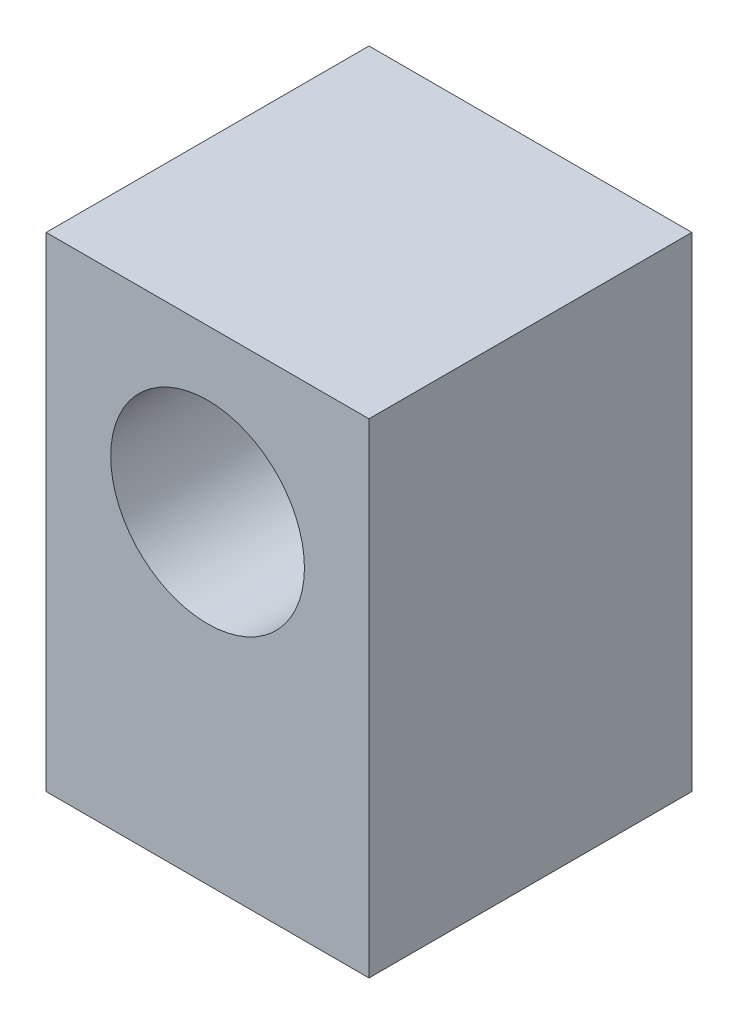
ISO-10303-21;
HEADER;
FILE_DESCRIPTION(('STEP AP214'),'2;1');
FILE_NAME('part.step','',(''),(''),'','','');
FILE_SCHEMA(('AUTOMOTIVE_DESIGN { 1 0 10303 214 1 1 1 1 }'));
ENDSEC;
DATA;
#1=APPLICATION_CONTEXT('core data for automotive mechanical design processes');
#2=APPLICATION_PROTOCOL_DEFINITION('international standard','automotive_design',2000,#1);
#3=PRODUCT_CONTEXT('',#1,'mechanical');
#4=PRODUCT('Part','Part','',(#3));
#5=PRODUCT_RELATED_PRODUCT_CATEGORY('part','',(#4));
#6=PRODUCT_DEFINITION_FORMATION('','',#4);
#7=PRODUCT_DEFINITION_CONTEXT('part definition',#1,'design');
#8=PRODUCT_DEFINITION('design','',#6,#7);
#9=PRODUCT_DEFINITION_SHAPE('','',#8);
#10=(LENGTH_UNIT() NAMED_UNIT(*) SI_UNIT(.MILLI.,.METRE.));
#11=(NAMED_UNIT(*) PLANE_ANGLE_UNIT() SI_UNIT($,.RADIAN.));
#12=(NAMED_UNIT(*) SI_UNIT($,.STERADIAN.) SOLID_ANGLE_UNIT());
#13=UNCERTAINTY_MEASURE_WITH_UNIT(LENGTH_MEASURE(1.E-05),#10,'distance_accuracy_value','');
#14=(GEOMETRIC_REPRESENTATION_CONTEXT(3) GLOBAL_UNCERTAINTY_ASSIGNED_CONTEXT((#13)) GLOBAL_UNIT_ASSIGNED_CONTEXT((#10,
#11,#12)) REPRESENTATION_CONTEXT('',''));
#15=CARTESIAN_POINT('',(0.,0.,0.));
#16=DIRECTION('',(0.,0.,1.));
#17=DIRECTION('',(1.,0.,0.));
#18=AXIS2_PLACEMENT_3D('',#15,#16,#17);
#19=CARTESIAN_POINT('',(10.,30.,-10.));
#20=DIRECTION('',(-1.,0.,0.));
#21=DIRECTION('',(0.,0.,1.));
#22=AXIS2_PLACEMENT_3D('',#19,#20,#21);
#23=PLANE('',#22);
#24=DIRECTION('',(0.,0.,-1.));
#25=VECTOR('',#24,1.);
#26=CARTESIAN_POINT('',(10.,0.,-10.));
#27=LINE('',#26,#25);
#28=CARTESIAN_POINT('',(10.,0.,10.));
#29=VERTEX_POINT('',#28);
#30=CARTESIAN_POINT('',(10.,0.,-10.));
#31=VERTEX_POINT('',#30);
#32=EDGE_CURVE('E96',#29,#31,#27,.T.);
#33=ORIENTED_EDGE('',*,*,#32,.T.);
#34=DIRECTION('',(0.,-1.,0.));
#35=VECTOR('',#34,1.);
#36=CARTESIAN_POINT('',(10.,30.,-10.));
#37=LINE('',#36,#35);
#38=CARTESIAN_POINT('',(10.,30.,-10.));
#39=VERTEX_POINT('',#38);
#40=EDGE_CURVE('E11',#39,#31,#37,.T.);
#41=ORIENTED_EDGE('',*,*,#40,.F.);
#42=DIRECTION('',(0.,0.,-1.));
#43=VECTOR('',#42,1.);
#44=CARTESIAN_POINT('',(10.,30.,-10.));
#45=LINE('',#44,#43);
#46=CARTESIAN_POINT('',(10.,30.,10.));
#47=VERTEX_POINT('',#46);
#48=EDGE_CURVE('E84',#47,#39,#45,.T.);
#49=ORIENTED_EDGE('',*,*,#48,.F.);
#50=DIRECTION('',(0.,-1.,0.));
#51=VECTOR('',#50,1.);
#52=CARTESIAN_POINT('',(10.,30.,10.));
#53=LINE('',#52,#51);
#54=EDGE_CURVE('E92',#47,#29,#53,.T.);
#55=ORIENTED_EDGE('',*,*,#54,.T.);
#56=EDGE_LOOP('',(#33,#41,#49,#55));
#57=FACE_BOUND('',#56,.T.);
#58=ADVANCED_FACE('F33',(#57),#23,.F.);
#59=CARTESIAN_POINT('',(-10.,30.,-10.));
#60=DIRECTION('',(0.,0.,1.));
#61=DIRECTION('',(1.,0.,0.));
#62=AXIS2_PLACEMENT_3D('',#59,#60,#61);
#63=PLANE('',#62);
#64=CARTESIAN_POINT('',(0.,20.,-10.));
#65=DIRECTION('',(0.,0.,1.));
#66=DIRECTION('',(1.,0.,0.));
#67=AXIS2_PLACEMENT_3D('',#64,#65,#66);
#68=CIRCLE('',#67,6.);
#69=CARTESIAN_POINT('',(6.,20.,-10.));
#70=VERTEX_POINT('',#69);
#71=EDGE_CURVE('E99',#70,#70,#68,.F.);
#72=ORIENTED_EDGE('',*,*,#71,.F.);
#73=EDGE_LOOP('',(#72));
#74=FACE_BOUND('',#73,.T.);
#75=DIRECTION('',(-1.,0.,0.));
#76=VECTOR('',#75,1.);
#77=CARTESIAN_POINT('',(-10.,0.,-10.));
#78=LINE('',#77,#76);
#79=CARTESIAN_POINT('',(-10.,0.,-10.));
#80=VERTEX_POINT('',#79);
#81=EDGE_CURVE('E88',#31,#80,#78,.T.);
#82=ORIENTED_EDGE('',*,*,#81,.T.);
#83=DIRECTION('',(0.,-1.,0.));
#84=VECTOR('',#83,1.);
#85=CARTESIAN_POINT('',(-10.,30.,-10.));
#86=LINE('',#85,#84);
#87=CARTESIAN_POINT('',(-10.,30.,-10.));
#88=VERTEX_POINT('',#87);
#89=EDGE_CURVE('E41',#88,#80,#86,.T.);
#90=ORIENTED_EDGE('',*,*,#89,.F.);
#91=DIRECTION('',(-1.,0.,0.));
#92=VECTOR('',#91,1.);
#93=CARTESIAN_POINT('',(-10.,30.,-10.));
#94=LINE('',#93,#92);
#95=EDGE_CURVE('E79',#39,#88,#94,.T.);
#96=ORIENTED_EDGE('',*,*,#95,.F.);
#97=ORIENTED_EDGE('',*,*,#40,.T.);
#98=EDGE_LOOP('',(#82,#90,#96,#97));
#99=FACE_BOUND('',#98,.T.);
#100=ADVANCED_FACE('F87',(#74,#99),#63,.F.);
#101=CARTESIAN_POINT('',(-10.,30.,-10.));
#102=DIRECTION('',(1.,0.,0.));
#103=DIRECTION('',(0.,0.,-1.));
#104=AXIS2_PLACEMENT_3D('',#101,#102,#103);
#105=PLANE('',#104);
#106=DIRECTION('',(0.,0.,1.));
#107=VECTOR('',#106,1.);
#108=CARTESIAN_POINT('',(-10.,0.,-10.));
#109=LINE('',#108,#107);
#110=CARTESIAN_POINT('',(-10.,0.,10.));
#111=VERTEX_POINT('',#110);
#112=EDGE_CURVE('E66',#80,#111,#109,.T.);
#113=ORIENTED_EDGE('',*,*,#112,.T.);
#114=DIRECTION('',(0.,-1.,0.));
#115=VECTOR('',#114,1.);
#116=CARTESIAN_POINT('',(-10.,30.,10.));
#117=LINE('',#116,#115);
#118=CARTESIAN_POINT('',(-10.,30.,10.));
#119=VERTEX_POINT('',#118);
#120=EDGE_CURVE('E89',#119,#111,#117,.T.);
#121=ORIENTED_EDGE('',*,*,#120,.F.);
#122=DIRECTION('',(0.,0.,1.));
#123=VECTOR('',#122,1.);
#124=CARTESIAN_POINT('',(-10.,30.,-10.));
#125=LINE('',#124,#123);
#126=EDGE_CURVE('E82',#88,#119,#125,.T.);
#127=ORIENTED_EDGE('',*,*,#126,.F.);
#128=ORIENTED_EDGE('',*,*,#89,.T.);
#129=EDGE_LOOP('',(#113,#121,#127,#128));
#130=FACE_BOUND('',#129,.T.);
#131=ADVANCED_FACE('F90',(#130),#105,.F.);
#132=CARTESIAN_POINT('',(-10.,30.,10.));
#133=DIRECTION('',(0.,0.,-1.));
#134=DIRECTION('',(-1.,0.,0.));
#135=AXIS2_PLACEMENT_3D('',#132,#133,#134);
#136=PLANE('',#135);
#137=CARTESIAN_POINT('',(0.,20.,10.));
#138=DIRECTION('',(0.,0.,1.));
#139=DIRECTION('',(1.,0.,0.));
#140=AXIS2_PLACEMENT_3D('',#137,#138,#139);
#141=CIRCLE('',#140,6.);
#142=CARTESIAN_POINT('',(6.,20.,10.));
#143=VERTEX_POINT('',#142);
#144=EDGE_CURVE('E112',#143,#143,#141,.T.);
#145=ORIENTED_EDGE('',*,*,#144,.F.);
#146=EDGE_LOOP('',(#145));
#147=FACE_BOUND('',#146,.T.);
#148=DIRECTION('',(1.,0.,0.));
#149=VECTOR('',#148,1.);
#150=CARTESIAN_POINT('',(-10.,0.,10.));
#151=LINE('',#150,#149);
#152=EDGE_CURVE('E72',#111,#29,#151,.T.);
#153=ORIENTED_EDGE('',*,*,#152,.T.);
#154=ORIENTED_EDGE('',*,*,#54,.F.);
#155=DIRECTION('',(1.,0.,0.));
#156=VECTOR('',#155,1.);
#157=CARTESIAN_POINT('',(-10.,30.,10.));
#158=LINE('',#157,#156);
#159=EDGE_CURVE('E49',#119,#47,#158,.T.);
#160=ORIENTED_EDGE('',*,*,#159,.F.);
#161=ORIENTED_EDGE('',*,*,#120,.T.);
#162=EDGE_LOOP('',(#153,#154,#160,#161));
#163=FACE_BOUND('',#162,.T.);
#164=ADVANCED_FACE('F104',(#147,#163),#136,.F.);
#165=CARTESIAN_POINT('',(0.,30.,0.));
#166=DIRECTION('',(0.,1.,0.));
#167=DIRECTION('',(0.,0.,1.));
#168=AXIS2_PLACEMENT_3D('',#165,#166,#167);
#169=PLANE('',#168);
#170=ORIENTED_EDGE('',*,*,#48,.T.);
#171=ORIENTED_EDGE('',*,*,#95,.T.);
#172=ORIENTED_EDGE('',*,*,#126,.T.);
#173=ORIENTED_EDGE('',*,*,#159,.T.);
#174=EDGE_LOOP('',(#170,#171,#172,#173));
#175=FACE_BOUND('',#174,.T.);
#176=ADVANCED_FACE('F80',(#175),#169,.T.);
#177=CARTESIAN_POINT('',(0.,0.,0.));
#178=DIRECTION('',(0.,1.,0.));
#179=DIRECTION('',(0.,0.,1.));
#180=AXIS2_PLACEMENT_3D('',#177,#178,#179);
#181=PLANE('',#180);
#182=CARTESIAN_POINT('',(0.,0.,0.));
#183=DIRECTION('',(0.,-1.,0.));
#184=DIRECTION('',(0.,0.,-1.));
#185=AXIS2_PLACEMENT_3D('',#182,#183,#184);
#186=CIRCLE('',#185,5.);
#187=CARTESIAN_POINT('',(0.,0.,-5.));
#188=VERTEX_POINT('',#187);
#189=EDGE_CURVE('E116',#188,#188,#186,.T.);
#190=ORIENTED_EDGE('',*,*,#189,.F.);
#191=EDGE_LOOP('',(#190));
#192=FACE_BOUND('',#191,.T.);
#193=ORIENTED_EDGE('',*,*,#32,.F.);
#194=ORIENTED_EDGE('',*,*,#152,.F.);
#195=ORIENTED_EDGE('',*,*,#112,.F.);
#196=ORIENTED_EDGE('',*,*,#81,.F.);
#197=EDGE_LOOP('',(#193,#194,#195,#196));
#198=FACE_BOUND('',#197,.T.);
#199=ADVANCED_FACE('F107',(#192,#198),#181,.F.);
#200=CARTESIAN_POINT('',(0.,20.,-10.001));
#201=DIRECTION('',(0.,0.,1.));
#202=DIRECTION('',(1.,0.,0.));
#203=AXIS2_PLACEMENT_3D('',#200,#201,#202);
#204=CYLINDRICAL_SURFACE('',#203,6.);
#205=ORIENTED_EDGE('',*,*,#144,.T.);
#206=EDGE_LOOP('',(#205));
#207=FACE_BOUND('',#206,.T.);
#208=ORIENTED_EDGE('',*,*,#71,.T.);
#209=EDGE_LOOP('',(#208));
#210=FACE_BOUND('',#209,.T.);
#211=ADVANCED_FACE('F127',(#207,#210),#204,.F.);
#212=CARTESIAN_POINT('',(0.,8.,0.));
#213=DIRECTION('',(0.,-1.,0.));
#214=DIRECTION('',(0.,0.,-1.));
#215=AXIS2_PLACEMENT_3D('',#212,#213,#214);
#216=CYLINDRICAL_SURFACE('',#215,5.);
#217=CARTESIAN_POINT('',(0.,8.,0.));
#218=DIRECTION('',(0.,-1.,0.));
#219=DIRECTION('',(0.,0.,-1.));
#220=AXIS2_PLACEMENT_3D('',#217,#218,#219);
#221=CIRCLE('',#220,5.);
#222=CARTESIAN_POINT('',(0.,8.,-5.));
#223=VERTEX_POINT('',#222);
#224=EDGE_CURVE('E115',#223,#223,#221,.T.);
#225=ORIENTED_EDGE('',*,*,#224,.F.);
#226=EDGE_LOOP('',(#225));
#227=FACE_BOUND('',#226,.T.);
#228=ORIENTED_EDGE('',*,*,#189,.T.);
#229=EDGE_LOOP('',(#228));
#230=FACE_BOUND('',#229,.T.);
#231=ADVANCED_FACE('F124',(#227,#230),#216,.F.);
#232=CARTESIAN_POINT('',(0.,8.,0.));
#233=DIRECTION('',(0.,-1.,0.));
#234=DIRECTION('',(0.,0.,-1.));
#235=AXIS2_PLACEMENT_3D('',#232,#233,#234);
#236=PLANE('',#235);
#237=ORIENTED_EDGE('',*,*,#224,.T.);
#238=EDGE_LOOP('',(#237));
#239=FACE_BOUND('',#238,.T.);
#240=ADVANCED_FACE('F122',(#239),#236,.T.);
#241=CLOSED_SHELL('',(#58,#100,#131,#164,#176,#199,#211,#231,#240));
#242=MANIFOLD_SOLID_BREP('B2',#241);
#243=ADVANCED_BREP_SHAPE_REPRESENTATION('',(#18,#242),#14);
#244=SHAPE_DEFINITION_REPRESENTATION(#9,#243);
ENDSEC;
END-ISO-10303-21;
